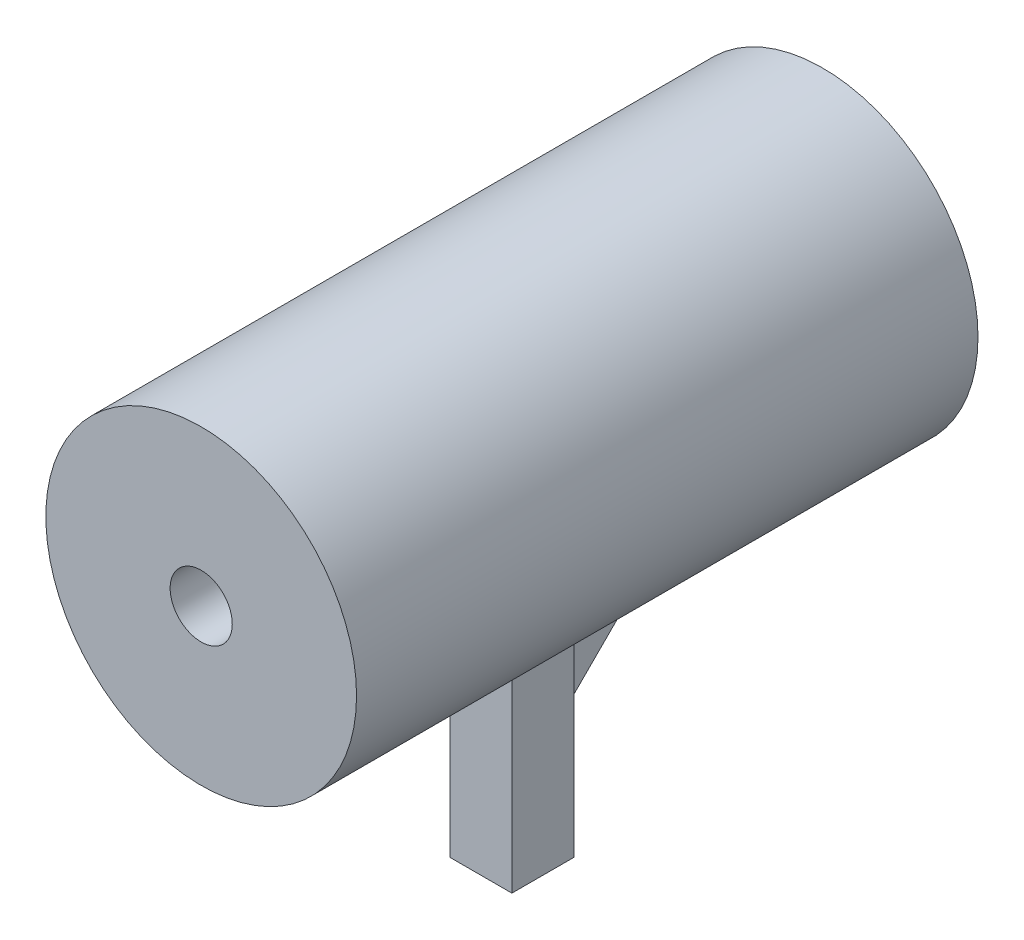
ISO-10303-21;
HEADER;
FILE_DESCRIPTION(('STEP AP214'),'2;1');
FILE_NAME('part.step','',(''),(''),'','','');
FILE_SCHEMA(('AUTOMOTIVE_DESIGN { 1 0 10303 214 1 1 1 1 }'));
ENDSEC;
DATA;
#1=APPLICATION_CONTEXT('core data for automotive mechanical design processes');
#2=APPLICATION_PROTOCOL_DEFINITION('international standard','automotive_design',2000,#1);
#3=PRODUCT_CONTEXT('',#1,'mechanical');
#4=PRODUCT('Part','Part','',(#3));
#5=PRODUCT_RELATED_PRODUCT_CATEGORY('part','',(#4));
#6=PRODUCT_DEFINITION_FORMATION('','',#4);
#7=PRODUCT_DEFINITION_CONTEXT('part definition',#1,'design');
#8=PRODUCT_DEFINITION('design','',#6,#7);
#9=PRODUCT_DEFINITION_SHAPE('','',#8);
#10=(LENGTH_UNIT() NAMED_UNIT(*) SI_UNIT(.MILLI.,.METRE.));
#11=(NAMED_UNIT(*) PLANE_ANGLE_UNIT() SI_UNIT($,.RADIAN.));
#12=(NAMED_UNIT(*) SI_UNIT($,.STERADIAN.) SOLID_ANGLE_UNIT());
#13=UNCERTAINTY_MEASURE_WITH_UNIT(LENGTH_MEASURE(1.E-05),#10,'distance_accuracy_value','');
#14=(GEOMETRIC_REPRESENTATION_CONTEXT(3) GLOBAL_UNCERTAINTY_ASSIGNED_CONTEXT((#13)) GLOBAL_UNIT_ASSIGNED_CONTEXT((#10,
#11,#12)) REPRESENTATION_CONTEXT('',''));
#15=CARTESIAN_POINT('',(0.,0.,0.));
#16=DIRECTION('',(0.,0.,1.));
#17=DIRECTION('',(1.,0.,0.));
#18=AXIS2_PLACEMENT_3D('',#15,#16,#17);
#19=CARTESIAN_POINT('',(0.,0.,-10.));
#20=DIRECTION('',(0.,0.,1.));
#21=DIRECTION('',(1.,0.,0.));
#22=AXIS2_PLACEMENT_3D('',#19,#20,#21);
#23=CYLINDRICAL_SURFACE('',#22,5.);
#24=CARTESIAN_POINT('',(0.,0.,10.));
#25=DIRECTION('',(0.,0.,1.));
#26=DIRECTION('',(1.,0.,0.));
#27=AXIS2_PLACEMENT_3D('',#24,#25,#26);
#28=CIRCLE('',#27,5.);
#29=CARTESIAN_POINT('',(5.,0.,10.));
#30=VERTEX_POINT('',#29);
#31=EDGE_CURVE('E138',#30,#30,#28,.T.);
#32=ORIENTED_EDGE('',*,*,#31,.F.);
#33=EDGE_LOOP('',(#32));
#34=FACE_BOUND('',#33,.T.);
#35=CARTESIAN_POINT('',(0.,0.,-10.));
#36=DIRECTION('',(0.,0.,1.));
#37=DIRECTION('',(1.,0.,0.));
#38=AXIS2_PLACEMENT_3D('',#35,#36,#37);
#39=CIRCLE('',#38,5.);
#40=CARTESIAN_POINT('',(5.,0.,-10.));
#41=VERTEX_POINT('',#40);
#42=EDGE_CURVE('E144',#41,#41,#39,.T.);
#43=ORIENTED_EDGE('',*,*,#42,.T.);
#44=EDGE_LOOP('',(#43));
#45=FACE_BOUND('',#44,.T.);
#46=CARTESIAN_POINT('',(0.,0.,-9.44948974278321));
#47=DIRECTION('',(0.,-0.707106781186549,-0.707106781186546));
#48=DIRECTION('',(0.,-0.707106781186546,0.707106781186549));
#49=AXIS2_PLACEMENT_3D('',#46,#47,#48);
#50=ELLIPSE('',#49,7.07106781186549,5.);
#51=CARTESIAN_POINT('',(-0.5,-4.9749371855331,-4.47455255725009));
#52=VERTEX_POINT('',#51);
#53=CARTESIAN_POINT('',(0.5,-4.9749371855331,-4.47455255725009));
#54=VERTEX_POINT('',#53);
#55=EDGE_CURVE('E46',#52,#54,#50,.F.);
#56=ORIENTED_EDGE('',*,*,#55,.F.);
#57=DIRECTION('',(0.,0.,1.));
#58=VECTOR('',#57,1.);
#59=CARTESIAN_POINT('',(-0.5,-4.9749371855331,-10.));
#60=LINE('',#59,#58);
#61=CARTESIAN_POINT('',(-0.5,-4.9749371855331,-1.));
#62=VERTEX_POINT('',#61);
#63=EDGE_CURVE('E108',#52,#62,#60,.T.);
#64=ORIENTED_EDGE('',*,*,#63,.T.);
#65=CARTESIAN_POINT('',(0.,0.,-1.));
#66=DIRECTION('',(0.,0.,-1.));
#67=DIRECTION('',(-1.,0.,0.));
#68=AXIS2_PLACEMENT_3D('',#65,#66,#67);
#69=CIRCLE('',#68,5.);
#70=CARTESIAN_POINT('',(-1.,-4.89897948556636,-1.));
#71=VERTEX_POINT('',#70);
#72=EDGE_CURVE('E154',#71,#62,#69,.F.);
#73=ORIENTED_EDGE('',*,*,#72,.F.);
#74=DIRECTION('',(0.,0.,1.));
#75=VECTOR('',#74,1.);
#76=CARTESIAN_POINT('',(-1.,-4.89897948556636,-10.));
#77=LINE('',#76,#75);
#78=CARTESIAN_POINT('',(-1.,-4.89897948556636,0.999999999999999));
#79=VERTEX_POINT('',#78);
#80=EDGE_CURVE('E102',#79,#71,#77,.F.);
#81=ORIENTED_EDGE('',*,*,#80,.F.);
#82=CARTESIAN_POINT('',(0.,0.,0.999999999999999));
#83=DIRECTION('',(0.,0.,1.));
#84=DIRECTION('',(1.,0.,0.));
#85=AXIS2_PLACEMENT_3D('',#82,#83,#84);
#86=CIRCLE('',#85,5.);
#87=CARTESIAN_POINT('',(1.,-4.89897948556636,0.999999999999999));
#88=VERTEX_POINT('',#87);
#89=EDGE_CURVE('E147',#88,#79,#86,.F.);
#90=ORIENTED_EDGE('',*,*,#89,.F.);
#91=DIRECTION('',(0.,0.,1.));
#92=VECTOR('',#91,1.);
#93=CARTESIAN_POINT('',(1.,-4.89897948556636,-10.));
#94=LINE('',#93,#92);
#95=CARTESIAN_POINT('',(1.,-4.89897948556636,-1.));
#96=VERTEX_POINT('',#95);
#97=EDGE_CURVE('E150',#96,#88,#94,.T.);
#98=ORIENTED_EDGE('',*,*,#97,.F.);
#99=CARTESIAN_POINT('',(0.5,-4.9749371855331,-1.));
#100=VERTEX_POINT('',#99);
#101=EDGE_CURVE('E153',#100,#96,#69,.F.);
#102=ORIENTED_EDGE('',*,*,#101,.F.);
#103=DIRECTION('',(0.,0.,1.));
#104=VECTOR('',#103,1.);
#105=CARTESIAN_POINT('',(0.5,-4.9749371855331,-10.));
#106=LINE('',#105,#104);
#107=EDGE_CURVE('E51',#54,#100,#106,.T.);
#108=ORIENTED_EDGE('',*,*,#107,.F.);
#109=EDGE_LOOP('',(#56,#64,#73,#81,#90,#98,#102,#108));
#110=FACE_BOUND('',#109,.T.);
#111=ADVANCED_FACE('F32',(#34,#45,#110),#23,.T.);
#112=CARTESIAN_POINT('',(1.,-12.,-1.));
#113=DIRECTION('',(0.,0.,-1.));
#114=DIRECTION('',(-1.,0.,0.));
#115=AXIS2_PLACEMENT_3D('',#112,#113,#114);
#116=PLANE('',#115);
#117=ORIENTED_EDGE('',*,*,#72,.T.);
#118=DIRECTION('',(0.,-1.,0.));
#119=VECTOR('',#118,1.);
#120=CARTESIAN_POINT('',(-0.5,-12.,-1.));
#121=LINE('',#120,#119);
#122=CARTESIAN_POINT('',(-0.5,-8.44948974278318,-1.));
#123=VERTEX_POINT('',#122);
#124=EDGE_CURVE('E11',#62,#123,#121,.T.);
#125=ORIENTED_EDGE('',*,*,#124,.T.);
#126=DIRECTION('',(1.,0.,0.));
#127=VECTOR('',#126,1.);
#128=CARTESIAN_POINT('',(-0.5,-8.44948974278318,-1.));
#129=LINE('',#128,#127);
#130=CARTESIAN_POINT('',(0.5,-8.44948974278318,-1.));
#131=VERTEX_POINT('',#130);
#132=EDGE_CURVE('E87',#123,#131,#129,.T.);
#133=ORIENTED_EDGE('',*,*,#132,.T.);
#134=DIRECTION('',(0.,-1.,0.));
#135=VECTOR('',#134,1.);
#136=CARTESIAN_POINT('',(0.5,-12.,-1.));
#137=LINE('',#136,#135);
#138=EDGE_CURVE('E39',#100,#131,#137,.T.);
#139=ORIENTED_EDGE('',*,*,#138,.F.);
#140=ORIENTED_EDGE('',*,*,#101,.T.);
#141=DIRECTION('',(0.,1.,0.));
#142=VECTOR('',#141,1.);
#143=CARTESIAN_POINT('',(1.,-12.,-1.));
#144=LINE('',#143,#142);
#145=CARTESIAN_POINT('',(1.,-12.,-1.));
#146=VERTEX_POINT('',#145);
#147=EDGE_CURVE('E128',#146,#96,#144,.T.);
#148=ORIENTED_EDGE('',*,*,#147,.F.);
#149=DIRECTION('',(-1.,0.,0.));
#150=VECTOR('',#149,1.);
#151=CARTESIAN_POINT('',(1.,-12.,-1.));
#152=LINE('',#151,#150);
#153=CARTESIAN_POINT('',(-1.,-12.,-1.));
#154=VERTEX_POINT('',#153);
#155=EDGE_CURVE('E120',#146,#154,#152,.T.);
#156=ORIENTED_EDGE('',*,*,#155,.T.);
#157=DIRECTION('',(0.,1.,0.));
#158=VECTOR('',#157,1.);
#159=CARTESIAN_POINT('',(-1.,-12.,-1.));
#160=LINE('',#159,#158);
#161=EDGE_CURVE('E124',#154,#71,#160,.T.);
#162=ORIENTED_EDGE('',*,*,#161,.T.);
#163=EDGE_LOOP('',(#117,#125,#133,#139,#140,#148,#156,#162));
#164=FACE_BOUND('',#163,.T.);
#165=ADVANCED_FACE('F90',(#164),#116,.T.);
#166=CARTESIAN_POINT('',(0.,0.,-10.));
#167=DIRECTION('',(0.,0.,1.));
#168=DIRECTION('',(1.,0.,0.));
#169=AXIS2_PLACEMENT_3D('',#166,#167,#168);
#170=PLANE('',#169);
#171=CARTESIAN_POINT('',(0.,0.,-10.));
#172=DIRECTION('',(0.,0.,1.));
#173=DIRECTION('',(1.,0.,0.));
#174=AXIS2_PLACEMENT_3D('',#171,#172,#173);
#175=CIRCLE('',#174,1.);
#176=CARTESIAN_POINT('',(1.,0.,-10.));
#177=VERTEX_POINT('',#176);
#178=EDGE_CURVE('E141',#177,#177,#175,.T.);
#179=ORIENTED_EDGE('',*,*,#178,.T.);
#180=EDGE_LOOP('',(#179));
#181=FACE_BOUND('',#180,.T.);
#182=ORIENTED_EDGE('',*,*,#42,.F.);
#183=EDGE_LOOP('',(#182));
#184=FACE_BOUND('',#183,.T.);
#185=ADVANCED_FACE('F185',(#181,#184),#170,.F.);
#186=CARTESIAN_POINT('',(0.,0.,-10.));
#187=DIRECTION('',(0.,0.,1.));
#188=DIRECTION('',(1.,0.,0.));
#189=AXIS2_PLACEMENT_3D('',#186,#187,#188);
#190=CYLINDRICAL_SURFACE('',#189,1.);
#191=ORIENTED_EDGE('',*,*,#178,.F.);
#192=EDGE_LOOP('',(#191));
#193=FACE_BOUND('',#192,.T.);
#194=CARTESIAN_POINT('',(0.,0.,10.));
#195=DIRECTION('',(0.,0.,1.));
#196=DIRECTION('',(1.,0.,0.));
#197=AXIS2_PLACEMENT_3D('',#194,#195,#196);
#198=CIRCLE('',#197,1.);
#199=CARTESIAN_POINT('',(1.,0.,10.));
#200=VERTEX_POINT('',#199);
#201=EDGE_CURVE('E127',#200,#200,#198,.T.);
#202=ORIENTED_EDGE('',*,*,#201,.T.);
#203=EDGE_LOOP('',(#202));
#204=FACE_BOUND('',#203,.T.);
#205=ADVANCED_FACE('F191',(#193,#204),#190,.F.);
#206=CARTESIAN_POINT('',(0.,0.,10.));
#207=DIRECTION('',(0.,0.,1.));
#208=DIRECTION('',(1.,0.,0.));
#209=AXIS2_PLACEMENT_3D('',#206,#207,#208);
#210=PLANE('',#209);
#211=ORIENTED_EDGE('',*,*,#31,.T.);
#212=EDGE_LOOP('',(#211));
#213=FACE_BOUND('',#212,.T.);
#214=ORIENTED_EDGE('',*,*,#201,.F.);
#215=EDGE_LOOP('',(#214));
#216=FACE_BOUND('',#215,.T.);
#217=ADVANCED_FACE('F177',(#213,#216),#210,.T.);
#218=CARTESIAN_POINT('',(-1.,-12.,1.));
#219=DIRECTION('',(-1.,0.,0.));
#220=DIRECTION('',(0.,0.,1.));
#221=AXIS2_PLACEMENT_3D('',#218,#219,#220);
#222=PLANE('',#221);
#223=DIRECTION('',(0.,1.,0.));
#224=VECTOR('',#223,1.);
#225=CARTESIAN_POINT('',(-1.,-12.,1.));
#226=LINE('',#225,#224);
#227=CARTESIAN_POINT('',(-1.,-12.,1.));
#228=VERTEX_POINT('',#227);
#229=EDGE_CURVE('E123',#228,#79,#226,.T.);
#230=ORIENTED_EDGE('',*,*,#229,.T.);
#231=ORIENTED_EDGE('',*,*,#80,.T.);
#232=ORIENTED_EDGE('',*,*,#161,.F.);
#233=DIRECTION('',(0.,0.,1.));
#234=VECTOR('',#233,1.);
#235=CARTESIAN_POINT('',(-1.,-12.,1.));
#236=LINE('',#235,#234);
#237=EDGE_CURVE('E111',#154,#228,#236,.T.);
#238=ORIENTED_EDGE('',*,*,#237,.T.);
#239=EDGE_LOOP('',(#230,#231,#232,#238));
#240=FACE_BOUND('',#239,.T.);
#241=ADVANCED_FACE('F158',(#240),#222,.T.);
#242=CARTESIAN_POINT('',(1.,-12.,1.));
#243=DIRECTION('',(1.,0.,0.));
#244=DIRECTION('',(0.,0.,-1.));
#245=AXIS2_PLACEMENT_3D('',#242,#243,#244);
#246=PLANE('',#245);
#247=ORIENTED_EDGE('',*,*,#147,.T.);
#248=ORIENTED_EDGE('',*,*,#97,.T.);
#249=DIRECTION('',(0.,1.,0.));
#250=VECTOR('',#249,1.);
#251=CARTESIAN_POINT('',(1.,-12.,1.));
#252=LINE('',#251,#250);
#253=CARTESIAN_POINT('',(1.,-12.,1.));
#254=VERTEX_POINT('',#253);
#255=EDGE_CURVE('E131',#254,#88,#252,.T.);
#256=ORIENTED_EDGE('',*,*,#255,.F.);
#257=DIRECTION('',(0.,0.,-1.));
#258=VECTOR('',#257,1.);
#259=CARTESIAN_POINT('',(1.,-12.,1.));
#260=LINE('',#259,#258);
#261=EDGE_CURVE('E117',#254,#146,#260,.T.);
#262=ORIENTED_EDGE('',*,*,#261,.T.);
#263=EDGE_LOOP('',(#247,#248,#256,#262));
#264=FACE_BOUND('',#263,.T.);
#265=ADVANCED_FACE('F169',(#264),#246,.T.);
#266=CARTESIAN_POINT('',(1.,-12.,1.));
#267=DIRECTION('',(0.,0.,1.));
#268=DIRECTION('',(1.,0.,0.));
#269=AXIS2_PLACEMENT_3D('',#266,#267,#268);
#270=PLANE('',#269);
#271=ORIENTED_EDGE('',*,*,#255,.T.);
#272=ORIENTED_EDGE('',*,*,#89,.T.);
#273=ORIENTED_EDGE('',*,*,#229,.F.);
#274=DIRECTION('',(1.,0.,0.));
#275=VECTOR('',#274,1.);
#276=CARTESIAN_POINT('',(1.,-12.,1.));
#277=LINE('',#276,#275);
#278=EDGE_CURVE('E114',#228,#254,#277,.T.);
#279=ORIENTED_EDGE('',*,*,#278,.T.);
#280=EDGE_LOOP('',(#271,#272,#273,#279));
#281=FACE_BOUND('',#280,.T.);
#282=ADVANCED_FACE('F166',(#281),#270,.T.);
#283=CARTESIAN_POINT('',(-1.,-12.,-1.));
#284=DIRECTION('',(0.,1.,0.));
#285=DIRECTION('',(0.,0.,1.));
#286=AXIS2_PLACEMENT_3D('',#283,#284,#285);
#287=PLANE('',#286);
#288=ORIENTED_EDGE('',*,*,#237,.F.);
#289=ORIENTED_EDGE('',*,*,#155,.F.);
#290=ORIENTED_EDGE('',*,*,#261,.F.);
#291=ORIENTED_EDGE('',*,*,#278,.F.);
#292=EDGE_LOOP('',(#288,#289,#290,#291));
#293=FACE_BOUND('',#292,.T.);
#294=ADVANCED_FACE('F163',(#293),#287,.F.);
#295=CARTESIAN_POINT('',(-0.5,-8.44948974278318,-1.));
#296=DIRECTION('',(0.,-0.707106781186549,-0.707106781186546));
#297=DIRECTION('',(0.,0.707106781186546,-0.707106781186549));
#298=AXIS2_PLACEMENT_3D('',#295,#296,#297);
#299=PLANE('',#298);
#300=DIRECTION('',(0.,0.707106781186546,-0.707106781186549));
#301=VECTOR('',#300,1.);
#302=CARTESIAN_POINT('',(-0.5,-8.44948974278318,-1.));
#303=LINE('',#302,#301);
#304=EDGE_CURVE('E96',#123,#52,#303,.T.);
#305=ORIENTED_EDGE('',*,*,#304,.T.);
#306=ORIENTED_EDGE('',*,*,#55,.T.);
#307=DIRECTION('',(0.,0.707106781186546,-0.707106781186549));
#308=VECTOR('',#307,1.);
#309=CARTESIAN_POINT('',(0.5,-8.44948974278318,-1.));
#310=LINE('',#309,#308);
#311=EDGE_CURVE('E101',#131,#54,#310,.T.);
#312=ORIENTED_EDGE('',*,*,#311,.F.);
#313=ORIENTED_EDGE('',*,*,#132,.F.);
#314=EDGE_LOOP('',(#305,#306,#312,#313));
#315=FACE_BOUND('',#314,.T.);
#316=ADVANCED_FACE('F103',(#315),#299,.T.);
#317=CARTESIAN_POINT('',(-0.5,-4.89897948556636,-1.));
#318=DIRECTION('',(1.,0.,0.));
#319=DIRECTION('',(0.,0.,-1.));
#320=AXIS2_PLACEMENT_3D('',#317,#318,#319);
#321=PLANE('',#320);
#322=ORIENTED_EDGE('',*,*,#63,.F.);
#323=ORIENTED_EDGE('',*,*,#304,.F.);
#324=ORIENTED_EDGE('',*,*,#124,.F.);
#325=EDGE_LOOP('',(#322,#323,#324));
#326=FACE_BOUND('',#325,.T.);
#327=ADVANCED_FACE('F249',(#326),#321,.F.);
#328=CARTESIAN_POINT('',(0.5,-4.89897948556636,-1.));
#329=DIRECTION('',(1.,0.,0.));
#330=DIRECTION('',(0.,0.,-1.));
#331=AXIS2_PLACEMENT_3D('',#328,#329,#330);
#332=PLANE('',#331);
#333=ORIENTED_EDGE('',*,*,#311,.T.);
#334=ORIENTED_EDGE('',*,*,#107,.T.);
#335=ORIENTED_EDGE('',*,*,#138,.T.);
#336=EDGE_LOOP('',(#333,#334,#335));
#337=FACE_BOUND('',#336,.T.);
#338=ADVANCED_FACE('F100',(#337),#332,.T.);
#339=CLOSED_SHELL('',(#111,#165,#185,#205,#217,#241,#265,#282,#294,#316,#327,#338));
#340=MANIFOLD_SOLID_BREP('B2',#339);
#341=ADVANCED_BREP_SHAPE_REPRESENTATION('',(#18,#340),#14);
#342=SHAPE_DEFINITION_REPRESENTATION(#9,#341);
ENDSEC;
END-ISO-10303-21;
